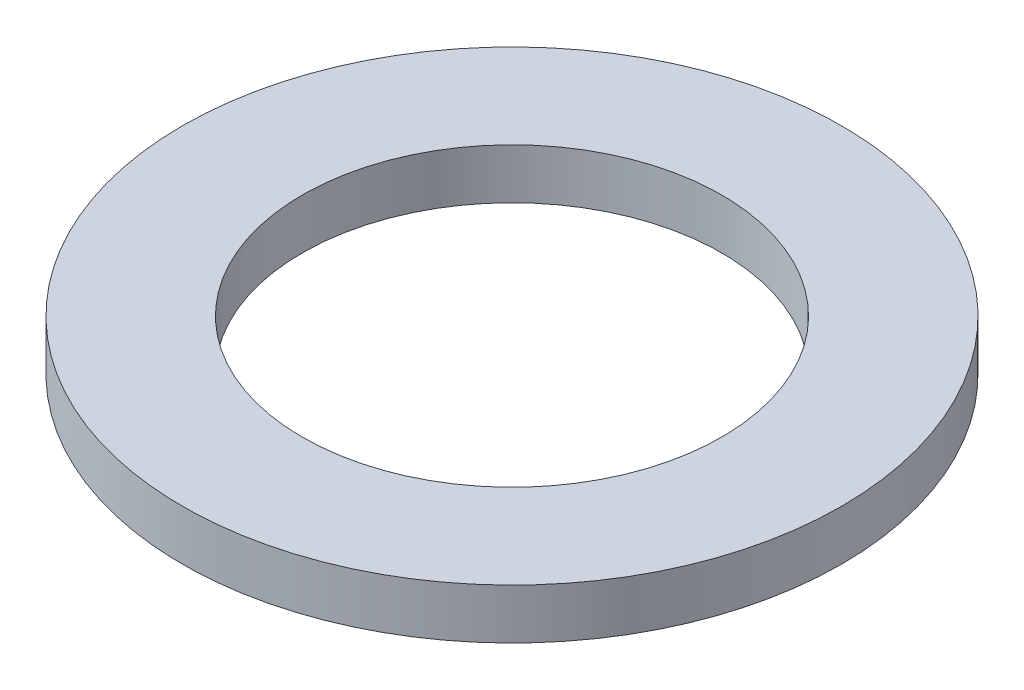
ISO-10303-21;
HEADER;
FILE_DESCRIPTION(('STEP AP214'),'2;1');
FILE_NAME('part.step','',(''),(''),'','','');
FILE_SCHEMA(('AUTOMOTIVE_DESIGN { 1 0 10303 214 1 1 1 1 }'));
ENDSEC;
DATA;
#1=APPLICATION_CONTEXT('core data for automotive mechanical design processes');
#2=APPLICATION_PROTOCOL_DEFINITION('international standard','automotive_design',2000,#1);
#3=PRODUCT_CONTEXT('',#1,'mechanical');
#4=PRODUCT('Part','Part','',(#3));
#5=PRODUCT_RELATED_PRODUCT_CATEGORY('part','',(#4));
#6=PRODUCT_DEFINITION_FORMATION('','',#4);
#7=PRODUCT_DEFINITION_CONTEXT('part definition',#1,'design');
#8=PRODUCT_DEFINITION('design','',#6,#7);
#9=PRODUCT_DEFINITION_SHAPE('','',#8);
#10=(LENGTH_UNIT() NAMED_UNIT(*) SI_UNIT(.MILLI.,.METRE.));
#11=(NAMED_UNIT(*) PLANE_ANGLE_UNIT() SI_UNIT($,.RADIAN.));
#12=(NAMED_UNIT(*) SI_UNIT($,.STERADIAN.) SOLID_ANGLE_UNIT());
#13=UNCERTAINTY_MEASURE_WITH_UNIT(LENGTH_MEASURE(1.E-05),#10,'distance_accuracy_value','');
#14=(GEOMETRIC_REPRESENTATION_CONTEXT(3) GLOBAL_UNCERTAINTY_ASSIGNED_CONTEXT((#13)) GLOBAL_UNIT_ASSIGNED_CONTEXT((#10,
#11,#12)) REPRESENTATION_CONTEXT('',''));
#15=CARTESIAN_POINT('',(0.,0.,0.));
#16=DIRECTION('',(0.,0.,1.));
#17=DIRECTION('',(1.,0.,0.));
#18=AXIS2_PLACEMENT_3D('',#15,#16,#17);
#19=CARTESIAN_POINT('',(0.,3.35,0.));
#20=DIRECTION('',(0.,1.,0.));
#21=DIRECTION('',(0.,0.,1.));
#22=AXIS2_PLACEMENT_3D('',#19,#20,#21);
#23=PLANE('',#22);
#24=CARTESIAN_POINT('',(0.,3.35,0.));
#25=DIRECTION('',(0.,1.,0.));
#26=DIRECTION('',(1.,0.,0.));
#27=AXIS2_PLACEMENT_3D('',#24,#25,#26);
#28=CIRCLE('',#27,22.);
#29=CARTESIAN_POINT('',(22.,3.35,0.));
#30=VERTEX_POINT('',#29);
#31=EDGE_CURVE('E11',#30,#30,#28,.T.);
#32=ORIENTED_EDGE('',*,*,#31,.T.);
#33=EDGE_LOOP('',(#32));
#34=FACE_BOUND('',#33,.T.);
#35=CARTESIAN_POINT('',(0.,3.35,0.));
#36=DIRECTION('',(0.,1.,0.));
#37=DIRECTION('',(0.,0.,1.));
#38=AXIS2_PLACEMENT_3D('',#35,#36,#37);
#39=CIRCLE('',#38,14.);
#40=CARTESIAN_POINT('',(0.,3.35,14.));
#41=VERTEX_POINT('',#40);
#42=EDGE_CURVE('E58',#41,#41,#39,.T.);
#43=ORIENTED_EDGE('',*,*,#42,.F.);
#44=EDGE_LOOP('',(#43));
#45=FACE_BOUND('',#44,.T.);
#46=ADVANCED_FACE('F45',(#34,#45),#23,.T.);
#47=CARTESIAN_POINT('',(0.,0.,0.));
#48=DIRECTION('',(0.,1.,0.));
#49=DIRECTION('',(0.,0.,1.));
#50=AXIS2_PLACEMENT_3D('',#47,#48,#49);
#51=PLANE('',#50);
#52=CARTESIAN_POINT('',(0.,0.,0.));
#53=DIRECTION('',(0.,1.,0.));
#54=DIRECTION('',(1.,0.,0.));
#55=AXIS2_PLACEMENT_3D('',#52,#53,#54);
#56=CIRCLE('',#55,22.);
#57=CARTESIAN_POINT('',(22.,0.,0.));
#58=VERTEX_POINT('',#57);
#59=EDGE_CURVE('E49',#58,#58,#56,.T.);
#60=ORIENTED_EDGE('',*,*,#59,.F.);
#61=EDGE_LOOP('',(#60));
#62=FACE_BOUND('',#61,.T.);
#63=CARTESIAN_POINT('',(0.,0.,0.));
#64=DIRECTION('',(0.,1.,0.));
#65=DIRECTION('',(0.,0.,1.));
#66=AXIS2_PLACEMENT_3D('',#63,#64,#65);
#67=CIRCLE('',#66,14.);
#68=CARTESIAN_POINT('',(0.,0.,14.));
#69=VERTEX_POINT('',#68);
#70=EDGE_CURVE('E60',#69,#69,#67,.T.);
#71=ORIENTED_EDGE('',*,*,#70,.T.);
#72=EDGE_LOOP('',(#71));
#73=FACE_BOUND('',#72,.T.);
#74=ADVANCED_FACE('F72',(#62,#73),#51,.F.);
#75=CARTESIAN_POINT('',(0.,3.35,0.));
#76=DIRECTION('',(0.,-1.,0.));
#77=DIRECTION('',(0.,0.,-1.));
#78=AXIS2_PLACEMENT_3D('',#75,#76,#77);
#79=CYLINDRICAL_SURFACE('',#78,22.);
#80=ORIENTED_EDGE('',*,*,#31,.F.);
#81=EDGE_LOOP('',(#80));
#82=FACE_BOUND('',#81,.T.);
#83=ORIENTED_EDGE('',*,*,#59,.T.);
#84=EDGE_LOOP('',(#83));
#85=FACE_BOUND('',#84,.T.);
#86=ADVANCED_FACE('F47',(#82,#85),#79,.T.);
#87=CARTESIAN_POINT('',(0.,3.35,0.));
#88=DIRECTION('',(0.,-1.,0.));
#89=DIRECTION('',(0.,0.,-1.));
#90=AXIS2_PLACEMENT_3D('',#87,#88,#89);
#91=CYLINDRICAL_SURFACE('',#90,14.);
#92=ORIENTED_EDGE('',*,*,#42,.T.);
#93=EDGE_LOOP('',(#92));
#94=FACE_BOUND('',#93,.T.);
#95=ORIENTED_EDGE('',*,*,#70,.F.);
#96=EDGE_LOOP('',(#95));
#97=FACE_BOUND('',#96,.T.);
#98=ADVANCED_FACE('F68',(#94,#97),#91,.F.);
#99=CLOSED_SHELL('',(#46,#74,#86,#98));
#100=MANIFOLD_SOLID_BREP('B2',#99);
#101=ADVANCED_BREP_SHAPE_REPRESENTATION('',(#18,#100),#14);
#102=SHAPE_DEFINITION_REPRESENTATION(#9,#101);
ENDSEC;
END-ISO-10303-21;
